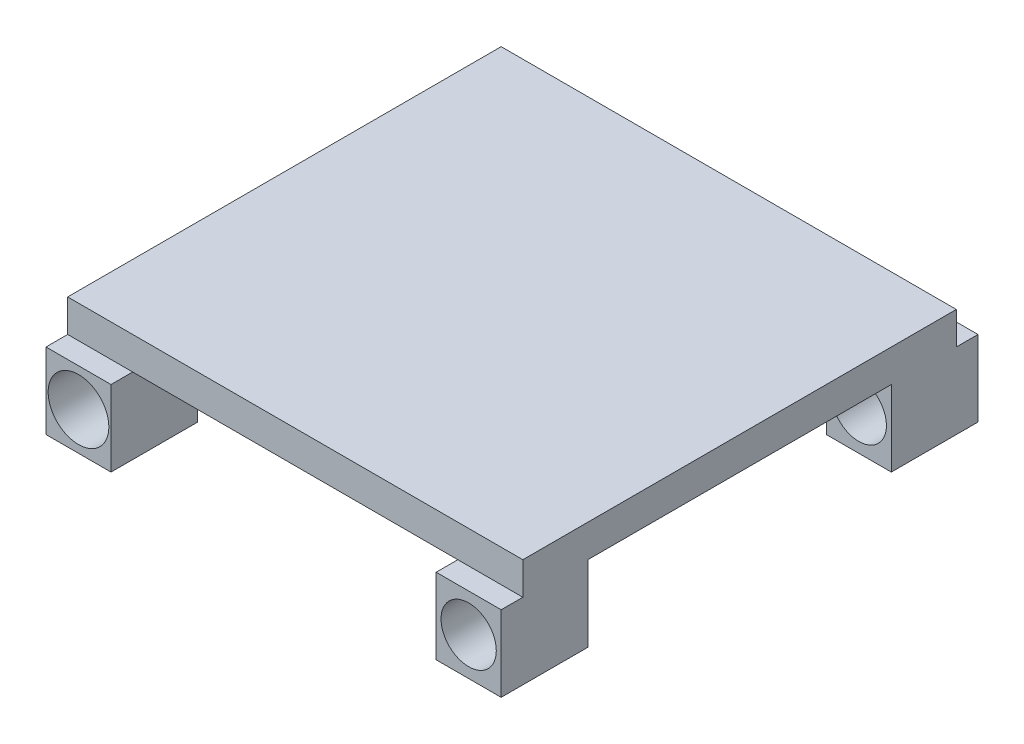
ISO-10303-21;
HEADER;
FILE_DESCRIPTION(('STEP AP214'),'2;1');
FILE_NAME('part.step','',(''),(''),'','','');
FILE_SCHEMA(('AUTOMOTIVE_DESIGN { 1 0 10303 214 1 1 1 1 }'));
ENDSEC;
DATA;
#1=APPLICATION_CONTEXT('core data for automotive mechanical design processes');
#2=APPLICATION_PROTOCOL_DEFINITION('international standard','automotive_design',2000,#1);
#3=PRODUCT_CONTEXT('',#1,'mechanical');
#4=PRODUCT('Part','Part','',(#3));
#5=PRODUCT_RELATED_PRODUCT_CATEGORY('part','',(#4));
#6=PRODUCT_DEFINITION_FORMATION('','',#4);
#7=PRODUCT_DEFINITION_CONTEXT('part definition',#1,'design');
#8=PRODUCT_DEFINITION('design','',#6,#7);
#9=PRODUCT_DEFINITION_SHAPE('','',#8);
#10=(LENGTH_UNIT() NAMED_UNIT(*) SI_UNIT(.MILLI.,.METRE.));
#11=(NAMED_UNIT(*) PLANE_ANGLE_UNIT() SI_UNIT($,.RADIAN.));
#12=(NAMED_UNIT(*) SI_UNIT($,.STERADIAN.) SOLID_ANGLE_UNIT());
#13=UNCERTAINTY_MEASURE_WITH_UNIT(LENGTH_MEASURE(1.E-05),#10,'distance_accuracy_value','');
#14=(GEOMETRIC_REPRESENTATION_CONTEXT(3) GLOBAL_UNCERTAINTY_ASSIGNED_CONTEXT((#13)) GLOBAL_UNIT_ASSIGNED_CONTEXT((#10,
#11,#12)) REPRESENTATION_CONTEXT('',''));
#15=CARTESIAN_POINT('',(0.,0.,0.));
#16=DIRECTION('',(0.,0.,1.));
#17=DIRECTION('',(1.,0.,0.));
#18=AXIS2_PLACEMENT_3D('',#15,#16,#17);
#19=CARTESIAN_POINT('',(0.,0.,0.));
#20=DIRECTION('',(0.,-1.,0.));
#21=DIRECTION('',(0.,0.,-1.));
#22=AXIS2_PLACEMENT_3D('',#19,#20,#21);
#23=PLANE('',#22);
#24=DIRECTION('',(0.,0.,1.));
#25=VECTOR('',#24,1.);
#26=CARTESIAN_POINT('',(-127.864290172266,0.,-75.));
#27=LINE('',#26,#25);
#28=CARTESIAN_POINT('',(-127.864290172266,0.,-45.));
#29=VERTEX_POINT('',#28);
#30=CARTESIAN_POINT('',(-127.864290172266,0.,95.));
#31=VERTEX_POINT('',#30);
#32=EDGE_CURVE('E222',#29,#31,#27,.T.);
#33=ORIENTED_EDGE('',*,*,#32,.F.);
#34=DIRECTION('',(-1.,0.,0.));
#35=VECTOR('',#34,1.);
#36=CARTESIAN_POINT('',(-97.8642901722655,0.,-45.));
#37=LINE('',#36,#35);
#38=CARTESIAN_POINT('',(-97.8642901722655,0.,-45.));
#39=VERTEX_POINT('',#38);
#40=EDGE_CURVE('E214',#39,#29,#37,.T.);
#41=ORIENTED_EDGE('',*,*,#40,.F.);
#42=DIRECTION('',(0.,0.,1.));
#43=VECTOR('',#42,1.);
#44=CARTESIAN_POINT('',(-97.8642901722656,0.,-85.));
#45=LINE('',#44,#43);
#46=CARTESIAN_POINT('',(-97.8642901722656,0.,-75.));
#47=VERTEX_POINT('',#46);
#48=EDGE_CURVE('E199',#47,#39,#45,.T.);
#49=ORIENTED_EDGE('',*,*,#48,.F.);
#50=DIRECTION('',(-1.,0.,0.));
#51=VECTOR('',#50,1.);
#52=CARTESIAN_POINT('',(-127.864290172266,0.,-75.));
#53=LINE('',#52,#51);
#54=CARTESIAN_POINT('',(52.1357098277344,0.,-75.));
#55=VERTEX_POINT('',#54);
#56=EDGE_CURVE('E390',#55,#47,#53,.T.);
#57=ORIENTED_EDGE('',*,*,#56,.F.);
#58=DIRECTION('',(0.,0.,1.));
#59=VECTOR('',#58,1.);
#60=CARTESIAN_POINT('',(52.1357098277345,0.,0.));
#61=LINE('',#60,#59);
#62=CARTESIAN_POINT('',(52.1357098277345,0.,-45.));
#63=VERTEX_POINT('',#62);
#64=EDGE_CURVE('E11',#55,#63,#61,.T.);
#65=ORIENTED_EDGE('',*,*,#64,.T.);
#66=DIRECTION('',(1.,0.,0.));
#67=VECTOR('',#66,1.);
#68=CARTESIAN_POINT('',(52.1357098277345,0.,-45.));
#69=LINE('',#68,#67);
#70=CARTESIAN_POINT('',(82.1357098277344,0.,-45.));
#71=VERTEX_POINT('',#70);
#72=EDGE_CURVE('E273',#63,#71,#69,.T.);
#73=ORIENTED_EDGE('',*,*,#72,.T.);
#74=DIRECTION('',(0.,0.,-1.));
#75=VECTOR('',#74,1.);
#76=CARTESIAN_POINT('',(82.1357098277345,0.,125.));
#77=LINE('',#76,#75);
#78=CARTESIAN_POINT('',(82.1357098277345,0.,95.));
#79=VERTEX_POINT('',#78);
#80=EDGE_CURVE('E363',#79,#71,#77,.T.);
#81=ORIENTED_EDGE('',*,*,#80,.F.);
#82=DIRECTION('',(1.,0.,0.));
#83=VECTOR('',#82,1.);
#84=CARTESIAN_POINT('',(52.1357098277345,0.,95.));
#85=LINE('',#84,#83);
#86=CARTESIAN_POINT('',(52.1357098277345,0.,95.));
#87=VERTEX_POINT('',#86);
#88=EDGE_CURVE('E364',#87,#79,#85,.T.);
#89=ORIENTED_EDGE('',*,*,#88,.F.);
#90=DIRECTION('',(0.,0.,1.));
#91=VECTOR('',#90,1.);
#92=CARTESIAN_POINT('',(52.1357098277345,0.,135.));
#93=LINE('',#92,#91);
#94=CARTESIAN_POINT('',(52.1357098277345,0.,125.));
#95=VERTEX_POINT('',#94);
#96=EDGE_CURVE('E341',#87,#95,#93,.T.);
#97=ORIENTED_EDGE('',*,*,#96,.T.);
#98=DIRECTION('',(1.,0.,0.));
#99=VECTOR('',#98,1.);
#100=CARTESIAN_POINT('',(-127.864290172266,0.,125.));
#101=LINE('',#100,#99);
#102=CARTESIAN_POINT('',(-97.8642901722655,0.,125.));
#103=VERTEX_POINT('',#102);
#104=EDGE_CURVE('E70',#103,#95,#101,.T.);
#105=ORIENTED_EDGE('',*,*,#104,.F.);
#106=DIRECTION('',(0.,0.,1.));
#107=VECTOR('',#106,1.);
#108=CARTESIAN_POINT('',(-97.8642901722655,0.,135.));
#109=LINE('',#108,#107);
#110=CARTESIAN_POINT('',(-97.8642901722655,0.,95.));
#111=VERTEX_POINT('',#110);
#112=EDGE_CURVE('E246',#111,#103,#109,.T.);
#113=ORIENTED_EDGE('',*,*,#112,.F.);
#114=DIRECTION('',(-1.,0.,0.));
#115=VECTOR('',#114,1.);
#116=CARTESIAN_POINT('',(-97.8642901722655,0.,95.));
#117=LINE('',#116,#115);
#118=EDGE_CURVE('E278',#111,#31,#117,.T.);
#119=ORIENTED_EDGE('',*,*,#118,.T.);
#120=EDGE_LOOP('',(#33,#41,#49,#57,#65,#73,#81,#89,#97,#105,#113,#119));
#121=FACE_BOUND('',#120,.T.);
#122=ADVANCED_FACE('F44',(#121),#23,.T.);
#123=CARTESIAN_POINT('',(82.1357098277345,15.,125.));
#124=DIRECTION('',(-1.,0.,0.));
#125=DIRECTION('',(0.,0.,1.));
#126=AXIS2_PLACEMENT_3D('',#123,#124,#125);
#127=PLANE('',#126);
#128=DIRECTION('',(0.,-1.,0.));
#129=VECTOR('',#128,1.);
#130=CARTESIAN_POINT('',(82.1357098277345,15.,125.));
#131=LINE('',#130,#129);
#132=CARTESIAN_POINT('',(82.1357098277345,15.,125.));
#133=VERTEX_POINT('',#132);
#134=CARTESIAN_POINT('',(82.1357098277345,0.,125.));
#135=VERTEX_POINT('',#134);
#136=EDGE_CURVE('E386',#133,#135,#131,.T.);
#137=ORIENTED_EDGE('',*,*,#136,.T.);
#138=DIRECTION('',(0.,0.,1.));
#139=VECTOR('',#138,1.);
#140=CARTESIAN_POINT('',(82.1357098277345,0.,135.));
#141=LINE('',#140,#139);
#142=CARTESIAN_POINT('',(82.1357098277345,0.,135.));
#143=VERTEX_POINT('',#142);
#144=EDGE_CURVE('E333',#135,#143,#141,.T.);
#145=ORIENTED_EDGE('',*,*,#144,.T.);
#146=DIRECTION('',(0.,-1.,0.));
#147=VECTOR('',#146,1.);
#148=CARTESIAN_POINT('',(82.1357098277345,-35.,135.));
#149=LINE('',#148,#147);
#150=CARTESIAN_POINT('',(82.1357098277345,-35.,135.));
#151=VERTEX_POINT('',#150);
#152=EDGE_CURVE('E313',#143,#151,#149,.T.);
#153=ORIENTED_EDGE('',*,*,#152,.T.);
#154=DIRECTION('',(0.,0.,-1.));
#155=VECTOR('',#154,1.);
#156=CARTESIAN_POINT('',(82.1357098277345,-35.,95.));
#157=LINE('',#156,#155);
#158=CARTESIAN_POINT('',(82.1357098277345,-35.,95.));
#159=VERTEX_POINT('',#158);
#160=EDGE_CURVE('E349',#151,#159,#157,.T.);
#161=ORIENTED_EDGE('',*,*,#160,.T.);
#162=DIRECTION('',(0.,1.,0.));
#163=VECTOR('',#162,1.);
#164=CARTESIAN_POINT('',(82.1357098277345,0.,95.));
#165=LINE('',#164,#163);
#166=EDGE_CURVE('E353',#159,#79,#165,.T.);
#167=ORIENTED_EDGE('',*,*,#166,.T.);
#168=ORIENTED_EDGE('',*,*,#80,.T.);
#169=DIRECTION('',(0.,-1.,0.));
#170=VECTOR('',#169,1.);
#171=CARTESIAN_POINT('',(82.1357098277344,0.,-45.));
#172=LINE('',#171,#170);
#173=CARTESIAN_POINT('',(82.1357098277344,-35.,-45.));
#174=VERTEX_POINT('',#173);
#175=EDGE_CURVE('E309',#71,#174,#172,.T.);
#176=ORIENTED_EDGE('',*,*,#175,.T.);
#177=DIRECTION('',(0.,0.,-1.));
#178=VECTOR('',#177,1.);
#179=CARTESIAN_POINT('',(82.1357098277344,-35.,-45.));
#180=LINE('',#179,#178);
#181=CARTESIAN_POINT('',(82.1357098277344,-35.,-85.));
#182=VERTEX_POINT('',#181);
#183=EDGE_CURVE('E305',#174,#182,#180,.T.);
#184=ORIENTED_EDGE('',*,*,#183,.T.);
#185=DIRECTION('',(0.,1.,0.));
#186=VECTOR('',#185,1.);
#187=CARTESIAN_POINT('',(82.1357098277344,-35.,-85.));
#188=LINE('',#187,#186);
#189=CARTESIAN_POINT('',(82.1357098277344,0.,-85.));
#190=VERTEX_POINT('',#189);
#191=EDGE_CURVE('E300',#182,#190,#188,.T.);
#192=ORIENTED_EDGE('',*,*,#191,.T.);
#193=DIRECTION('',(0.,0.,1.));
#194=VECTOR('',#193,1.);
#195=CARTESIAN_POINT('',(82.1357098277344,0.,-85.));
#196=LINE('',#195,#194);
#197=CARTESIAN_POINT('',(82.1357098277344,0.,-75.));
#198=VERTEX_POINT('',#197);
#199=EDGE_CURVE('E297',#190,#198,#196,.T.);
#200=ORIENTED_EDGE('',*,*,#199,.T.);
#201=DIRECTION('',(0.,-1.,0.));
#202=VECTOR('',#201,1.);
#203=CARTESIAN_POINT('',(82.1357098277344,15.,-75.));
#204=LINE('',#203,#202);
#205=CARTESIAN_POINT('',(82.1357098277344,15.,-75.));
#206=VERTEX_POINT('',#205);
#207=EDGE_CURVE('E54',#206,#198,#204,.T.);
#208=ORIENTED_EDGE('',*,*,#207,.F.);
#209=DIRECTION('',(0.,0.,-1.));
#210=VECTOR('',#209,1.);
#211=CARTESIAN_POINT('',(82.1357098277345,15.,125.));
#212=LINE('',#211,#210);
#213=EDGE_CURVE('E372',#133,#206,#212,.T.);
#214=ORIENTED_EDGE('',*,*,#213,.F.);
#215=EDGE_LOOP('',(#137,#145,#153,#161,#167,#168,#176,#184,#192,#200,#208,#214));
#216=FACE_BOUND('',#215,.T.);
#217=ADVANCED_FACE('F46',(#216),#127,.F.);
#218=CARTESIAN_POINT('',(-127.864290172266,15.,-75.));
#219=DIRECTION('',(0.,0.,1.));
#220=DIRECTION('',(1.,0.,0.));
#221=AXIS2_PLACEMENT_3D('',#218,#219,#220);
#222=PLANE('',#221);
#223=EDGE_CURVE('E391',#198,#55,#53,.T.);
#224=ORIENTED_EDGE('',*,*,#223,.T.);
#225=ORIENTED_EDGE('',*,*,#56,.T.);
#226=DIRECTION('',(1.,0.,0.));
#227=VECTOR('',#226,1.);
#228=CARTESIAN_POINT('',(-127.864290172266,0.,-75.));
#229=LINE('',#228,#227);
#230=CARTESIAN_POINT('',(-127.864290172266,0.,-75.));
#231=VERTEX_POINT('',#230);
#232=EDGE_CURVE('E236',#231,#47,#229,.T.);
#233=ORIENTED_EDGE('',*,*,#232,.F.);
#234=DIRECTION('',(0.,-1.,0.));
#235=VECTOR('',#234,1.);
#236=CARTESIAN_POINT('',(-127.864290172266,15.,-75.));
#237=LINE('',#236,#235);
#238=CARTESIAN_POINT('',(-127.864290172266,15.,-75.));
#239=VERTEX_POINT('',#238);
#240=EDGE_CURVE('E407',#239,#231,#237,.T.);
#241=ORIENTED_EDGE('',*,*,#240,.F.);
#242=DIRECTION('',(-1.,0.,0.));
#243=VECTOR('',#242,1.);
#244=CARTESIAN_POINT('',(-127.864290172266,15.,-75.));
#245=LINE('',#244,#243);
#246=EDGE_CURVE('E376',#206,#239,#245,.T.);
#247=ORIENTED_EDGE('',*,*,#246,.F.);
#248=ORIENTED_EDGE('',*,*,#207,.T.);
#249=EDGE_LOOP('',(#224,#225,#233,#241,#247,#248));
#250=FACE_BOUND('',#249,.T.);
#251=ADVANCED_FACE('F476',(#250),#222,.F.);
#252=CARTESIAN_POINT('',(-127.864290172266,15.,-75.));
#253=DIRECTION('',(1.,0.,0.));
#254=DIRECTION('',(0.,0.,-1.));
#255=AXIS2_PLACEMENT_3D('',#252,#253,#254);
#256=PLANE('',#255);
#257=ORIENTED_EDGE('',*,*,#240,.T.);
#258=DIRECTION('',(0.,0.,1.));
#259=VECTOR('',#258,1.);
#260=CARTESIAN_POINT('',(-127.864290172266,0.,-85.));
#261=LINE('',#260,#259);
#262=CARTESIAN_POINT('',(-127.864290172266,0.,-85.));
#263=VERTEX_POINT('',#262);
#264=EDGE_CURVE('E450',#263,#231,#261,.T.);
#265=ORIENTED_EDGE('',*,*,#264,.F.);
#266=DIRECTION('',(0.,1.,0.));
#267=VECTOR('',#266,1.);
#268=CARTESIAN_POINT('',(-127.864290172266,-35.,-85.));
#269=LINE('',#268,#267);
#270=CARTESIAN_POINT('',(-127.864290172266,-35.,-85.));
#271=VERTEX_POINT('',#270);
#272=EDGE_CURVE('E453',#271,#263,#269,.T.);
#273=ORIENTED_EDGE('',*,*,#272,.F.);
#274=DIRECTION('',(0.,0.,-1.));
#275=VECTOR('',#274,1.);
#276=CARTESIAN_POINT('',(-127.864290172266,-35.,-45.));
#277=LINE('',#276,#275);
#278=CARTESIAN_POINT('',(-127.864290172266,-35.,-45.));
#279=VERTEX_POINT('',#278);
#280=EDGE_CURVE('E219',#279,#271,#277,.T.);
#281=ORIENTED_EDGE('',*,*,#280,.F.);
#282=DIRECTION('',(0.,-1.,0.));
#283=VECTOR('',#282,1.);
#284=CARTESIAN_POINT('',(-127.864290172266,0.,-45.));
#285=LINE('',#284,#283);
#286=EDGE_CURVE('E62',#29,#279,#285,.T.);
#287=ORIENTED_EDGE('',*,*,#286,.F.);
#288=ORIENTED_EDGE('',*,*,#32,.T.);
#289=DIRECTION('',(0.,1.,0.));
#290=VECTOR('',#289,1.);
#291=CARTESIAN_POINT('',(-127.864290172266,0.,95.));
#292=LINE('',#291,#290);
#293=CARTESIAN_POINT('',(-127.864290172266,-35.,95.));
#294=VERTEX_POINT('',#293);
#295=EDGE_CURVE('E263',#294,#31,#292,.T.);
#296=ORIENTED_EDGE('',*,*,#295,.F.);
#297=DIRECTION('',(0.,0.,-1.));
#298=VECTOR('',#297,1.);
#299=CARTESIAN_POINT('',(-127.864290172266,-35.,95.));
#300=LINE('',#299,#298);
#301=CARTESIAN_POINT('',(-127.864290172266,-35.,135.));
#302=VERTEX_POINT('',#301);
#303=EDGE_CURVE('E245',#302,#294,#300,.T.);
#304=ORIENTED_EDGE('',*,*,#303,.F.);
#305=DIRECTION('',(0.,-1.,0.));
#306=VECTOR('',#305,1.);
#307=CARTESIAN_POINT('',(-127.864290172266,-35.,135.));
#308=LINE('',#307,#306);
#309=CARTESIAN_POINT('',(-127.864290172266,0.,135.));
#310=VERTEX_POINT('',#309);
#311=EDGE_CURVE('E239',#310,#302,#308,.T.);
#312=ORIENTED_EDGE('',*,*,#311,.F.);
#313=DIRECTION('',(0.,0.,1.));
#314=VECTOR('',#313,1.);
#315=CARTESIAN_POINT('',(-127.864290172266,0.,135.));
#316=LINE('',#315,#314);
#317=CARTESIAN_POINT('',(-127.864290172266,0.,125.));
#318=VERTEX_POINT('',#317);
#319=EDGE_CURVE('E260',#318,#310,#316,.T.);
#320=ORIENTED_EDGE('',*,*,#319,.F.);
#321=DIRECTION('',(0.,-1.,0.));
#322=VECTOR('',#321,1.);
#323=CARTESIAN_POINT('',(-127.864290172266,15.,125.));
#324=LINE('',#323,#322);
#325=CARTESIAN_POINT('',(-127.864290172266,15.,125.));
#326=VERTEX_POINT('',#325);
#327=EDGE_CURVE('E403',#326,#318,#324,.T.);
#328=ORIENTED_EDGE('',*,*,#327,.F.);
#329=DIRECTION('',(0.,0.,1.));
#330=VECTOR('',#329,1.);
#331=CARTESIAN_POINT('',(-127.864290172266,15.,-75.));
#332=LINE('',#331,#330);
#333=EDGE_CURVE('E380',#239,#326,#332,.T.);
#334=ORIENTED_EDGE('',*,*,#333,.F.);
#335=EDGE_LOOP('',(#257,#265,#273,#281,#287,#288,#296,#304,#312,#320,#328,#334));
#336=FACE_BOUND('',#335,.T.);
#337=ADVANCED_FACE('F469',(#336),#256,.F.);
#338=CARTESIAN_POINT('',(-127.864290172266,15.,125.));
#339=DIRECTION('',(0.,0.,-1.));
#340=DIRECTION('',(-1.,0.,0.));
#341=AXIS2_PLACEMENT_3D('',#338,#339,#340);
#342=PLANE('',#341);
#343=EDGE_CURVE('E377',#318,#103,#101,.T.);
#344=ORIENTED_EDGE('',*,*,#343,.T.);
#345=ORIENTED_EDGE('',*,*,#104,.T.);
#346=EDGE_CURVE('E397',#95,#135,#101,.T.);
#347=ORIENTED_EDGE('',*,*,#346,.T.);
#348=ORIENTED_EDGE('',*,*,#136,.F.);
#349=DIRECTION('',(1.,0.,0.));
#350=VECTOR('',#349,1.);
#351=CARTESIAN_POINT('',(-127.864290172266,15.,125.));
#352=LINE('',#351,#350);
#353=EDGE_CURVE('E383',#326,#133,#352,.T.);
#354=ORIENTED_EDGE('',*,*,#353,.F.);
#355=ORIENTED_EDGE('',*,*,#327,.T.);
#356=EDGE_LOOP('',(#344,#345,#347,#348,#354,#355));
#357=FACE_BOUND('',#356,.T.);
#358=ADVANCED_FACE('F504',(#357),#342,.F.);
#359=CARTESIAN_POINT('',(0.,15.,0.));
#360=DIRECTION('',(0.,-1.,0.));
#361=DIRECTION('',(0.,0.,-1.));
#362=AXIS2_PLACEMENT_3D('',#359,#360,#361);
#363=PLANE('',#362);
#364=ORIENTED_EDGE('',*,*,#213,.T.);
#365=ORIENTED_EDGE('',*,*,#246,.T.);
#366=ORIENTED_EDGE('',*,*,#333,.T.);
#367=ORIENTED_EDGE('',*,*,#353,.T.);
#368=EDGE_LOOP('',(#364,#365,#366,#367));
#369=FACE_BOUND('',#368,.T.);
#370=ADVANCED_FACE('F509',(#369),#363,.F.);
#371=CARTESIAN_POINT('',(52.1357098277345,0.,135.));
#372=DIRECTION('',(0.,1.,0.));
#373=DIRECTION('',(0.,0.,1.));
#374=AXIS2_PLACEMENT_3D('',#371,#372,#373);
#375=PLANE('',#374);
#376=ORIENTED_EDGE('',*,*,#346,.F.);
#377=CARTESIAN_POINT('',(52.1357098277345,0.,135.));
#378=VERTEX_POINT('',#377);
#379=EDGE_CURVE('E340',#95,#378,#93,.T.);
#380=ORIENTED_EDGE('',*,*,#379,.T.);
#381=DIRECTION('',(1.,0.,0.));
#382=VECTOR('',#381,1.);
#383=CARTESIAN_POINT('',(52.1357098277345,0.,135.));
#384=LINE('',#383,#382);
#385=EDGE_CURVE('E359',#378,#143,#384,.T.);
#386=ORIENTED_EDGE('',*,*,#385,.T.);
#387=ORIENTED_EDGE('',*,*,#144,.F.);
#388=EDGE_LOOP('',(#376,#380,#386,#387));
#389=FACE_BOUND('',#388,.T.);
#390=ADVANCED_FACE('F537',(#389),#375,.T.);
#391=CARTESIAN_POINT('',(52.1357098277345,-35.,135.));
#392=DIRECTION('',(0.,0.,1.));
#393=DIRECTION('',(1.,0.,0.));
#394=AXIS2_PLACEMENT_3D('',#391,#392,#393);
#395=PLANE('',#394);
#396=CARTESIAN_POINT('',(67.1357098277345,-17.5,135.));
#397=DIRECTION('',(0.,0.,1.));
#398=DIRECTION('',(1.,0.,0.));
#399=AXIS2_PLACEMENT_3D('',#396,#397,#398);
#400=CIRCLE('',#399,12.75);
#401=CARTESIAN_POINT('',(79.8857098277345,-17.5,135.));
#402=VERTEX_POINT('',#401);
#403=EDGE_CURVE('E417',#402,#402,#400,.T.);
#404=ORIENTED_EDGE('',*,*,#403,.F.);
#405=EDGE_LOOP('',(#404));
#406=FACE_BOUND('',#405,.T.);
#407=ORIENTED_EDGE('',*,*,#152,.F.);
#408=ORIENTED_EDGE('',*,*,#385,.F.);
#409=DIRECTION('',(0.,-1.,0.));
#410=VECTOR('',#409,1.);
#411=CARTESIAN_POINT('',(52.1357098277345,-35.,135.));
#412=LINE('',#411,#410);
#413=CARTESIAN_POINT('',(52.1357098277345,-35.,135.));
#414=VERTEX_POINT('',#413);
#415=EDGE_CURVE('E328',#378,#414,#412,.T.);
#416=ORIENTED_EDGE('',*,*,#415,.T.);
#417=DIRECTION('',(1.,0.,0.));
#418=VECTOR('',#417,1.);
#419=CARTESIAN_POINT('',(52.1357098277345,-35.,135.));
#420=LINE('',#419,#418);
#421=EDGE_CURVE('E345',#414,#151,#420,.T.);
#422=ORIENTED_EDGE('',*,*,#421,.T.);
#423=EDGE_LOOP('',(#407,#408,#416,#422));
#424=FACE_BOUND('',#423,.T.);
#425=ADVANCED_FACE('F541',(#406,#424),#395,.T.);
#426=CARTESIAN_POINT('',(52.1357098277345,0.,95.));
#427=DIRECTION('',(0.,0.,-1.));
#428=DIRECTION('',(-1.,0.,0.));
#429=AXIS2_PLACEMENT_3D('',#426,#427,#428);
#430=PLANE('',#429);
#431=CARTESIAN_POINT('',(67.1357098277345,-17.5,95.));
#432=DIRECTION('',(0.,0.,-1.));
#433=DIRECTION('',(-1.,0.,0.));
#434=AXIS2_PLACEMENT_3D('',#431,#432,#433);
#435=CIRCLE('',#434,12.75);
#436=CARTESIAN_POINT('',(54.3857098277345,-17.5,95.));
#437=VERTEX_POINT('',#436);
#438=EDGE_CURVE('E441',#437,#437,#435,.T.);
#439=ORIENTED_EDGE('',*,*,#438,.F.);
#440=EDGE_LOOP('',(#439));
#441=FACE_BOUND('',#440,.T.);
#442=ORIENTED_EDGE('',*,*,#166,.F.);
#443=DIRECTION('',(1.,0.,0.));
#444=VECTOR('',#443,1.);
#445=CARTESIAN_POINT('',(52.1357098277345,-35.,95.));
#446=LINE('',#445,#444);
#447=CARTESIAN_POINT('',(52.1357098277345,-35.,95.));
#448=VERTEX_POINT('',#447);
#449=EDGE_CURVE('E367',#448,#159,#446,.T.);
#450=ORIENTED_EDGE('',*,*,#449,.F.);
#451=DIRECTION('',(0.,1.,0.));
#452=VECTOR('',#451,1.);
#453=CARTESIAN_POINT('',(52.1357098277345,0.,95.));
#454=LINE('',#453,#452);
#455=EDGE_CURVE('E337',#448,#87,#454,.T.);
#456=ORIENTED_EDGE('',*,*,#455,.T.);
#457=ORIENTED_EDGE('',*,*,#88,.T.);
#458=EDGE_LOOP('',(#442,#450,#456,#457));
#459=FACE_BOUND('',#458,.T.);
#460=ADVANCED_FACE('F528',(#441,#459),#430,.T.);
#461=CARTESIAN_POINT('',(52.1357098277345,-35.,95.));
#462=DIRECTION('',(0.,-1.,0.));
#463=DIRECTION('',(0.,0.,-1.));
#464=AXIS2_PLACEMENT_3D('',#461,#462,#463);
#465=PLANE('',#464);
#466=ORIENTED_EDGE('',*,*,#160,.F.);
#467=ORIENTED_EDGE('',*,*,#421,.F.);
#468=DIRECTION('',(0.,0.,-1.));
#469=VECTOR('',#468,1.);
#470=CARTESIAN_POINT('',(52.1357098277345,-35.,95.));
#471=LINE('',#470,#469);
#472=EDGE_CURVE('E332',#414,#448,#471,.T.);
#473=ORIENTED_EDGE('',*,*,#472,.T.);
#474=ORIENTED_EDGE('',*,*,#449,.T.);
#475=EDGE_LOOP('',(#466,#467,#473,#474));
#476=FACE_BOUND('',#475,.T.);
#477=ADVANCED_FACE('F543',(#476),#465,.T.);
#478=CARTESIAN_POINT('',(52.1357098277345,0.,0.));
#479=DIRECTION('',(-1.,0.,0.));
#480=DIRECTION('',(0.,0.,1.));
#481=AXIS2_PLACEMENT_3D('',#478,#479,#480);
#482=PLANE('',#481);
#483=ORIENTED_EDGE('',*,*,#415,.F.);
#484=ORIENTED_EDGE('',*,*,#379,.F.);
#485=ORIENTED_EDGE('',*,*,#96,.F.);
#486=ORIENTED_EDGE('',*,*,#455,.F.);
#487=ORIENTED_EDGE('',*,*,#472,.F.);
#488=EDGE_LOOP('',(#483,#484,#485,#486,#487));
#489=FACE_BOUND('',#488,.T.);
#490=ADVANCED_FACE('F533',(#489),#482,.T.);
#491=CARTESIAN_POINT('',(52.1357098277344,0.,-85.));
#492=DIRECTION('',(0.,1.,0.));
#493=DIRECTION('',(0.,0.,1.));
#494=AXIS2_PLACEMENT_3D('',#491,#492,#493);
#495=PLANE('',#494);
#496=ORIENTED_EDGE('',*,*,#223,.F.);
#497=ORIENTED_EDGE('',*,*,#199,.F.);
#498=DIRECTION('',(1.,0.,0.));
#499=VECTOR('',#498,1.);
#500=CARTESIAN_POINT('',(52.1357098277344,0.,-85.));
#501=LINE('',#500,#499);
#502=CARTESIAN_POINT('',(52.1357098277344,0.,-85.));
#503=VERTEX_POINT('',#502);
#504=EDGE_CURVE('E291',#503,#190,#501,.T.);
#505=ORIENTED_EDGE('',*,*,#504,.F.);
#506=DIRECTION('',(0.,0.,1.));
#507=VECTOR('',#506,1.);
#508=CARTESIAN_POINT('',(52.1357098277344,0.,-85.));
#509=LINE('',#508,#507);
#510=EDGE_CURVE('E287',#503,#55,#509,.T.);
#511=ORIENTED_EDGE('',*,*,#510,.T.);
#512=EDGE_LOOP('',(#496,#497,#505,#511));
#513=FACE_BOUND('',#512,.T.);
#514=ADVANCED_FACE('F516',(#513),#495,.T.);
#515=CARTESIAN_POINT('',(52.1357098277345,0.,-45.));
#516=DIRECTION('',(0.,0.,1.));
#517=DIRECTION('',(0.,-1.,0.));
#518=AXIS2_PLACEMENT_3D('',#515,#516,#517);
#519=PLANE('',#518);
#520=CARTESIAN_POINT('',(67.1357098277345,-17.5,-45.));
#521=DIRECTION('',(0.,0.,1.));
#522=DIRECTION('',(0.,-1.,0.));
#523=AXIS2_PLACEMENT_3D('',#520,#521,#522);
#524=CIRCLE('',#523,12.75);
#525=CARTESIAN_POINT('',(67.1357098277345,-30.25,-45.));
#526=VERTEX_POINT('',#525);
#527=EDGE_CURVE('E437',#526,#526,#524,.T.);
#528=ORIENTED_EDGE('',*,*,#527,.F.);
#529=EDGE_LOOP('',(#528));
#530=FACE_BOUND('',#529,.T.);
#531=ORIENTED_EDGE('',*,*,#175,.F.);
#532=ORIENTED_EDGE('',*,*,#72,.F.);
#533=DIRECTION('',(0.,-1.,0.));
#534=VECTOR('',#533,1.);
#535=CARTESIAN_POINT('',(52.1357098277345,0.,-45.));
#536=LINE('',#535,#534);
#537=CARTESIAN_POINT('',(52.1357098277345,-35.,-45.));
#538=VERTEX_POINT('',#537);
#539=EDGE_CURVE('E301',#63,#538,#536,.T.);
#540=ORIENTED_EDGE('',*,*,#539,.T.);
#541=DIRECTION('',(1.,0.,0.));
#542=VECTOR('',#541,1.);
#543=CARTESIAN_POINT('',(52.1357098277345,-35.,-45.));
#544=LINE('',#543,#542);
#545=EDGE_CURVE('E284',#538,#174,#544,.T.);
#546=ORIENTED_EDGE('',*,*,#545,.T.);
#547=EDGE_LOOP('',(#531,#532,#540,#546));
#548=FACE_BOUND('',#547,.T.);
#549=ADVANCED_FACE('F607',(#530,#548),#519,.T.);
#550=CARTESIAN_POINT('',(52.1357098277344,-35.,-85.));
#551=DIRECTION('',(0.,0.,-1.));
#552=DIRECTION('',(0.,1.,0.));
#553=AXIS2_PLACEMENT_3D('',#550,#551,#552);
#554=PLANE('',#553);
#555=CARTESIAN_POINT('',(67.1357098277345,-17.5,-85.));
#556=DIRECTION('',(0.,0.,-1.));
#557=DIRECTION('',(0.,1.,0.));
#558=AXIS2_PLACEMENT_3D('',#555,#556,#557);
#559=CIRCLE('',#558,12.75);
#560=CARTESIAN_POINT('',(67.1357098277345,-4.75,-85.));
#561=VERTEX_POINT('',#560);
#562=EDGE_CURVE('E48',#561,#561,#559,.T.);
#563=ORIENTED_EDGE('',*,*,#562,.F.);
#564=EDGE_LOOP('',(#563));
#565=FACE_BOUND('',#564,.T.);
#566=ORIENTED_EDGE('',*,*,#191,.F.);
#567=DIRECTION('',(1.,0.,0.));
#568=VECTOR('',#567,1.);
#569=CARTESIAN_POINT('',(52.1357098277344,-35.,-85.));
#570=LINE('',#569,#568);
#571=CARTESIAN_POINT('',(52.1357098277344,-35.,-85.));
#572=VERTEX_POINT('',#571);
#573=EDGE_CURVE('E288',#572,#182,#570,.T.);
#574=ORIENTED_EDGE('',*,*,#573,.F.);
#575=DIRECTION('',(0.,1.,0.));
#576=VECTOR('',#575,1.);
#577=CARTESIAN_POINT('',(52.1357098277344,-35.,-85.));
#578=LINE('',#577,#576);
#579=EDGE_CURVE('E317',#572,#503,#578,.T.);
#580=ORIENTED_EDGE('',*,*,#579,.T.);
#581=ORIENTED_EDGE('',*,*,#504,.T.);
#582=EDGE_LOOP('',(#566,#574,#580,#581));
#583=FACE_BOUND('',#582,.T.);
#584=ADVANCED_FACE('F612',(#565,#583),#554,.T.);
#585=CARTESIAN_POINT('',(52.1357098277345,-35.,-45.));
#586=DIRECTION('',(0.,-1.,0.));
#587=DIRECTION('',(0.,0.,-1.));
#588=AXIS2_PLACEMENT_3D('',#585,#586,#587);
#589=PLANE('',#588);
#590=ORIENTED_EDGE('',*,*,#183,.F.);
#591=ORIENTED_EDGE('',*,*,#545,.F.);
#592=DIRECTION('',(0.,0.,-1.));
#593=VECTOR('',#592,1.);
#594=CARTESIAN_POINT('',(52.1357098277345,-35.,-45.));
#595=LINE('',#594,#593);
#596=EDGE_CURVE('E321',#538,#572,#595,.T.);
#597=ORIENTED_EDGE('',*,*,#596,.T.);
#598=ORIENTED_EDGE('',*,*,#573,.T.);
#599=EDGE_LOOP('',(#590,#591,#597,#598));
#600=FACE_BOUND('',#599,.T.);
#601=ADVANCED_FACE('F625',(#600),#589,.T.);
#602=CARTESIAN_POINT('',(52.1357098277345,0.,0.));
#603=DIRECTION('',(1.,0.,0.));
#604=DIRECTION('',(0.,0.,-1.));
#605=AXIS2_PLACEMENT_3D('',#602,#603,#604);
#606=PLANE('',#605);
#607=ORIENTED_EDGE('',*,*,#539,.F.);
#608=ORIENTED_EDGE('',*,*,#64,.F.);
#609=ORIENTED_EDGE('',*,*,#510,.F.);
#610=ORIENTED_EDGE('',*,*,#579,.F.);
#611=ORIENTED_EDGE('',*,*,#596,.F.);
#612=EDGE_LOOP('',(#607,#608,#609,#610,#611));
#613=FACE_BOUND('',#612,.T.);
#614=ADVANCED_FACE('F521',(#613),#606,.F.);
#615=CARTESIAN_POINT('',(-97.8642901722655,0.,135.));
#616=DIRECTION('',(0.,-1.,0.));
#617=DIRECTION('',(0.,0.,-1.));
#618=AXIS2_PLACEMENT_3D('',#615,#616,#617);
#619=PLANE('',#618);
#620=CARTESIAN_POINT('',(-97.8642901722655,0.,135.));
#621=VERTEX_POINT('',#620);
#622=EDGE_CURVE('E244',#103,#621,#109,.T.);
#623=ORIENTED_EDGE('',*,*,#622,.F.);
#624=ORIENTED_EDGE('',*,*,#343,.F.);
#625=ORIENTED_EDGE('',*,*,#319,.T.);
#626=DIRECTION('',(-1.,0.,0.));
#627=VECTOR('',#626,1.);
#628=CARTESIAN_POINT('',(-97.8642901722655,0.,135.));
#629=LINE('',#628,#627);
#630=EDGE_CURVE('E256',#621,#310,#629,.T.);
#631=ORIENTED_EDGE('',*,*,#630,.F.);
#632=EDGE_LOOP('',(#623,#624,#625,#631));
#633=FACE_BOUND('',#632,.T.);
#634=ADVANCED_FACE('F489',(#633),#619,.F.);
#635=CARTESIAN_POINT('',(-97.8642901722655,-35.,135.));
#636=DIRECTION('',(0.,0.,-1.));
#637=DIRECTION('',(-1.,0.,0.));
#638=AXIS2_PLACEMENT_3D('',#635,#636,#637);
#639=PLANE('',#638);
#640=CARTESIAN_POINT('',(-112.864290172266,-17.5,135.));
#641=DIRECTION('',(0.,0.,1.));
#642=DIRECTION('',(1.,0.,0.));
#643=AXIS2_PLACEMENT_3D('',#640,#641,#642);
#644=CIRCLE('',#643,14.);
#645=CARTESIAN_POINT('',(-98.8642901722655,-17.5,135.));
#646=VERTEX_POINT('',#645);
#647=EDGE_CURVE('E426',#646,#646,#644,.T.);
#648=ORIENTED_EDGE('',*,*,#647,.F.);
#649=EDGE_LOOP('',(#648));
#650=FACE_BOUND('',#649,.T.);
#651=ORIENTED_EDGE('',*,*,#311,.T.);
#652=DIRECTION('',(-1.,0.,0.));
#653=VECTOR('',#652,1.);
#654=CARTESIAN_POINT('',(-97.8642901722655,-35.,135.));
#655=LINE('',#654,#653);
#656=CARTESIAN_POINT('',(-97.8642901722655,-35.,135.));
#657=VERTEX_POINT('',#656);
#658=EDGE_CURVE('E269',#657,#302,#655,.T.);
#659=ORIENTED_EDGE('',*,*,#658,.F.);
#660=DIRECTION('',(0.,-1.,0.));
#661=VECTOR('',#660,1.);
#662=CARTESIAN_POINT('',(-97.8642901722655,-35.,135.));
#663=LINE('',#662,#661);
#664=EDGE_CURVE('E240',#621,#657,#663,.T.);
#665=ORIENTED_EDGE('',*,*,#664,.F.);
#666=ORIENTED_EDGE('',*,*,#630,.T.);
#667=EDGE_LOOP('',(#651,#659,#665,#666));
#668=FACE_BOUND('',#667,.T.);
#669=ADVANCED_FACE('F492',(#650,#668),#639,.F.);
#670=CARTESIAN_POINT('',(-97.8642901722655,-35.,95.));
#671=DIRECTION('',(0.,1.,0.));
#672=DIRECTION('',(0.,0.,1.));
#673=AXIS2_PLACEMENT_3D('',#670,#671,#672);
#674=PLANE('',#673);
#675=ORIENTED_EDGE('',*,*,#303,.T.);
#676=DIRECTION('',(-1.,0.,0.));
#677=VECTOR('',#676,1.);
#678=CARTESIAN_POINT('',(-97.8642901722655,-35.,95.));
#679=LINE('',#678,#677);
#680=CARTESIAN_POINT('',(-97.8642901722655,-35.,95.));
#681=VERTEX_POINT('',#680);
#682=EDGE_CURVE('E274',#681,#294,#679,.T.);
#683=ORIENTED_EDGE('',*,*,#682,.F.);
#684=DIRECTION('',(0.,0.,-1.));
#685=VECTOR('',#684,1.);
#686=CARTESIAN_POINT('',(-97.8642901722655,-35.,95.));
#687=LINE('',#686,#685);
#688=EDGE_CURVE('E253',#657,#681,#687,.T.);
#689=ORIENTED_EDGE('',*,*,#688,.F.);
#690=ORIENTED_EDGE('',*,*,#658,.T.);
#691=EDGE_LOOP('',(#675,#683,#689,#690));
#692=FACE_BOUND('',#691,.T.);
#693=ADVANCED_FACE('F494',(#692),#674,.F.);
#694=CARTESIAN_POINT('',(-97.8642901722655,0.,95.));
#695=DIRECTION('',(0.,0.,1.));
#696=DIRECTION('',(1.,0.,0.));
#697=AXIS2_PLACEMENT_3D('',#694,#695,#696);
#698=PLANE('',#697);
#699=CARTESIAN_POINT('',(-112.864290172266,-17.5,95.));
#700=DIRECTION('',(0.,0.,1.));
#701=DIRECTION('',(1.,0.,0.));
#702=AXIS2_PLACEMENT_3D('',#699,#700,#701);
#703=CIRCLE('',#702,14.);
#704=CARTESIAN_POINT('',(-98.8642901722655,-17.5,95.));
#705=VERTEX_POINT('',#704);
#706=EDGE_CURVE('E423',#705,#705,#703,.T.);
#707=ORIENTED_EDGE('',*,*,#706,.T.);
#708=EDGE_LOOP('',(#707));
#709=FACE_BOUND('',#708,.T.);
#710=ORIENTED_EDGE('',*,*,#295,.T.);
#711=ORIENTED_EDGE('',*,*,#118,.F.);
#712=DIRECTION('',(0.,1.,0.));
#713=VECTOR('',#712,1.);
#714=CARTESIAN_POINT('',(-97.8642901722655,0.,95.));
#715=LINE('',#714,#713);
#716=EDGE_CURVE('E250',#681,#111,#715,.T.);
#717=ORIENTED_EDGE('',*,*,#716,.F.);
#718=ORIENTED_EDGE('',*,*,#682,.T.);
#719=EDGE_LOOP('',(#710,#711,#717,#718));
#720=FACE_BOUND('',#719,.T.);
#721=ADVANCED_FACE('F499',(#709,#720),#698,.F.);
#722=CARTESIAN_POINT('',(-97.8642901722656,0.,0.));
#723=DIRECTION('',(1.,0.,0.));
#724=DIRECTION('',(0.,0.,1.));
#725=AXIS2_PLACEMENT_3D('',#722,#723,#724);
#726=PLANE('',#725);
#727=ORIENTED_EDGE('',*,*,#664,.T.);
#728=ORIENTED_EDGE('',*,*,#688,.T.);
#729=ORIENTED_EDGE('',*,*,#716,.T.);
#730=ORIENTED_EDGE('',*,*,#112,.T.);
#731=ORIENTED_EDGE('',*,*,#622,.T.);
#732=EDGE_LOOP('',(#727,#728,#729,#730,#731));
#733=FACE_BOUND('',#732,.T.);
#734=ADVANCED_FACE('F483',(#733),#726,.T.);
#735=CARTESIAN_POINT('',(-97.8642901722656,0.,-85.));
#736=DIRECTION('',(0.,-1.,0.));
#737=DIRECTION('',(0.,0.,-1.));
#738=AXIS2_PLACEMENT_3D('',#735,#736,#737);
#739=PLANE('',#738);
#740=ORIENTED_EDGE('',*,*,#264,.T.);
#741=ORIENTED_EDGE('',*,*,#232,.T.);
#742=CARTESIAN_POINT('',(-97.8642901722656,0.,-85.));
#743=VERTEX_POINT('',#742);
#744=EDGE_CURVE('E205',#743,#47,#45,.T.);
#745=ORIENTED_EDGE('',*,*,#744,.F.);
#746=DIRECTION('',(-1.,0.,0.));
#747=VECTOR('',#746,1.);
#748=CARTESIAN_POINT('',(-97.8642901722656,0.,-85.));
#749=LINE('',#748,#747);
#750=EDGE_CURVE('E224',#743,#263,#749,.T.);
#751=ORIENTED_EDGE('',*,*,#750,.T.);
#752=EDGE_LOOP('',(#740,#741,#745,#751));
#753=FACE_BOUND('',#752,.T.);
#754=ADVANCED_FACE('F474',(#753),#739,.F.);
#755=CARTESIAN_POINT('',(-97.8642901722655,0.,-45.));
#756=DIRECTION('',(0.,0.,-1.));
#757=DIRECTION('',(0.,1.,0.));
#758=AXIS2_PLACEMENT_3D('',#755,#756,#757);
#759=PLANE('',#758);
#760=CARTESIAN_POINT('',(-112.864290172266,-17.5,-45.));
#761=DIRECTION('',(0.,0.,-1.));
#762=DIRECTION('',(0.,1.,0.));
#763=AXIS2_PLACEMENT_3D('',#760,#761,#762);
#764=CIRCLE('',#763,14.);
#765=CARTESIAN_POINT('',(-112.864290172266,-3.5,-45.));
#766=VERTEX_POINT('',#765);
#767=EDGE_CURVE('E416',#766,#766,#764,.T.);
#768=ORIENTED_EDGE('',*,*,#767,.T.);
#769=EDGE_LOOP('',(#768));
#770=FACE_BOUND('',#769,.T.);
#771=ORIENTED_EDGE('',*,*,#286,.T.);
#772=DIRECTION('',(-1.,0.,0.));
#773=VECTOR('',#772,1.);
#774=CARTESIAN_POINT('',(-97.8642901722655,-35.,-45.));
#775=LINE('',#774,#773);
#776=CARTESIAN_POINT('',(-97.8642901722655,-35.,-45.));
#777=VERTEX_POINT('',#776);
#778=EDGE_CURVE('E217',#777,#279,#775,.T.);
#779=ORIENTED_EDGE('',*,*,#778,.F.);
#780=DIRECTION('',(0.,-1.,0.));
#781=VECTOR('',#780,1.);
#782=CARTESIAN_POINT('',(-97.8642901722655,0.,-45.));
#783=LINE('',#782,#781);
#784=EDGE_CURVE('E202',#39,#777,#783,.T.);
#785=ORIENTED_EDGE('',*,*,#784,.F.);
#786=ORIENTED_EDGE('',*,*,#40,.T.);
#787=EDGE_LOOP('',(#771,#779,#785,#786));
#788=FACE_BOUND('',#787,.T.);
#789=ADVANCED_FACE('F213',(#770,#788),#759,.F.);
#790=CARTESIAN_POINT('',(-97.8642901722655,-35.,-45.));
#791=DIRECTION('',(0.,1.,0.));
#792=DIRECTION('',(0.,0.,1.));
#793=AXIS2_PLACEMENT_3D('',#790,#791,#792);
#794=PLANE('',#793);
#795=ORIENTED_EDGE('',*,*,#280,.T.);
#796=DIRECTION('',(-1.,0.,0.));
#797=VECTOR('',#796,1.);
#798=CARTESIAN_POINT('',(-97.8642901722656,-35.,-85.));
#799=LINE('',#798,#797);
#800=CARTESIAN_POINT('',(-97.8642901722656,-35.,-85.));
#801=VERTEX_POINT('',#800);
#802=EDGE_CURVE('E230',#801,#271,#799,.T.);
#803=ORIENTED_EDGE('',*,*,#802,.F.);
#804=DIRECTION('',(0.,0.,-1.));
#805=VECTOR('',#804,1.);
#806=CARTESIAN_POINT('',(-97.8642901722655,-35.,-45.));
#807=LINE('',#806,#805);
#808=EDGE_CURVE('E225',#777,#801,#807,.T.);
#809=ORIENTED_EDGE('',*,*,#808,.F.);
#810=ORIENTED_EDGE('',*,*,#778,.T.);
#811=EDGE_LOOP('',(#795,#803,#809,#810));
#812=FACE_BOUND('',#811,.T.);
#813=ADVANCED_FACE('F664',(#812),#794,.F.);
#814=CARTESIAN_POINT('',(-97.8642901722656,-35.,-85.));
#815=DIRECTION('',(0.,0.,1.));
#816=DIRECTION('',(0.,-1.,0.));
#817=AXIS2_PLACEMENT_3D('',#814,#815,#816);
#818=PLANE('',#817);
#819=CARTESIAN_POINT('',(-112.864290172266,-17.5,-85.));
#820=DIRECTION('',(0.,0.,1.));
#821=DIRECTION('',(0.,-1.,0.));
#822=AXIS2_PLACEMENT_3D('',#819,#820,#821);
#823=CIRCLE('',#822,14.);
#824=CARTESIAN_POINT('',(-112.864290172266,-31.5,-85.));
#825=VERTEX_POINT('',#824);
#826=EDGE_CURVE('E413',#825,#825,#823,.T.);
#827=ORIENTED_EDGE('',*,*,#826,.T.);
#828=EDGE_LOOP('',(#827));
#829=FACE_BOUND('',#828,.T.);
#830=ORIENTED_EDGE('',*,*,#272,.T.);
#831=ORIENTED_EDGE('',*,*,#750,.F.);
#832=DIRECTION('',(0.,1.,0.));
#833=VECTOR('',#832,1.);
#834=CARTESIAN_POINT('',(-97.8642901722656,-35.,-85.));
#835=LINE('',#834,#833);
#836=EDGE_CURVE('E232',#801,#743,#835,.T.);
#837=ORIENTED_EDGE('',*,*,#836,.F.);
#838=ORIENTED_EDGE('',*,*,#802,.T.);
#839=EDGE_LOOP('',(#830,#831,#837,#838));
#840=FACE_BOUND('',#839,.T.);
#841=ADVANCED_FACE('F465',(#829,#840),#818,.F.);
#842=CARTESIAN_POINT('',(-97.8642901722655,0.,0.));
#843=DIRECTION('',(-1.,0.,0.));
#844=DIRECTION('',(0.,0.,-1.));
#845=AXIS2_PLACEMENT_3D('',#842,#843,#844);
#846=PLANE('',#845);
#847=ORIENTED_EDGE('',*,*,#784,.T.);
#848=ORIENTED_EDGE('',*,*,#808,.T.);
#849=ORIENTED_EDGE('',*,*,#836,.T.);
#850=ORIENTED_EDGE('',*,*,#744,.T.);
#851=ORIENTED_EDGE('',*,*,#48,.T.);
#852=EDGE_LOOP('',(#847,#848,#849,#850,#851));
#853=FACE_BOUND('',#852,.T.);
#854=ADVANCED_FACE('F201',(#853),#846,.F.);
#855=CARTESIAN_POINT('',(-112.864290172266,-17.5,-369.));
#856=DIRECTION('',(0.,0.,1.));
#857=DIRECTION('',(1.,0.,0.));
#858=AXIS2_PLACEMENT_3D('',#855,#856,#857);
#859=CYLINDRICAL_SURFACE('',#858,14.);
#860=ORIENTED_EDGE('',*,*,#826,.F.);
#861=EDGE_LOOP('',(#860));
#862=FACE_BOUND('',#861,.T.);
#863=ORIENTED_EDGE('',*,*,#767,.F.);
#864=EDGE_LOOP('',(#863));
#865=FACE_BOUND('',#864,.T.);
#866=ADVANCED_FACE('F686',(#862,#865),#859,.F.);
#867=ORIENTED_EDGE('',*,*,#647,.T.);
#868=EDGE_LOOP('',(#867));
#869=FACE_BOUND('',#868,.T.);
#870=ORIENTED_EDGE('',*,*,#706,.F.);
#871=EDGE_LOOP('',(#870));
#872=FACE_BOUND('',#871,.T.);
#873=ADVANCED_FACE('F691',(#869,#872),#859,.F.);
#874=CARTESIAN_POINT('',(67.1357098277345,-17.5,-369.));
#875=DIRECTION('',(0.,0.,1.));
#876=DIRECTION('',(1.,0.,0.));
#877=AXIS2_PLACEMENT_3D('',#874,#875,#876);
#878=CYLINDRICAL_SURFACE('',#877,12.75);
#879=ORIENTED_EDGE('',*,*,#527,.T.);
#880=EDGE_LOOP('',(#879));
#881=FACE_BOUND('',#880,.T.);
#882=ORIENTED_EDGE('',*,*,#562,.T.);
#883=EDGE_LOOP('',(#882));
#884=FACE_BOUND('',#883,.T.);
#885=ADVANCED_FACE('F702',(#881,#884),#878,.F.);
#886=ORIENTED_EDGE('',*,*,#438,.T.);
#887=EDGE_LOOP('',(#886));
#888=FACE_BOUND('',#887,.T.);
#889=ORIENTED_EDGE('',*,*,#403,.T.);
#890=EDGE_LOOP('',(#889));
#891=FACE_BOUND('',#890,.T.);
#892=ADVANCED_FACE('F712',(#888,#891),#878,.F.);
#893=CLOSED_SHELL('',(#122,#217,#251,#337,#358,#370,#390,#425,#460,#477,#490,#514,#549,#584,
#601,#614,#634,#669,#693,#721,#734,#754,#789,#813,#841,#854,#866,#873,#885,#892));
#894=MANIFOLD_SOLID_BREP('B2',#893);
#895=ADVANCED_BREP_SHAPE_REPRESENTATION('',(#18,#894),#14);
#896=SHAPE_DEFINITION_REPRESENTATION(#9,#895);
ENDSEC;
END-ISO-10303-21;
